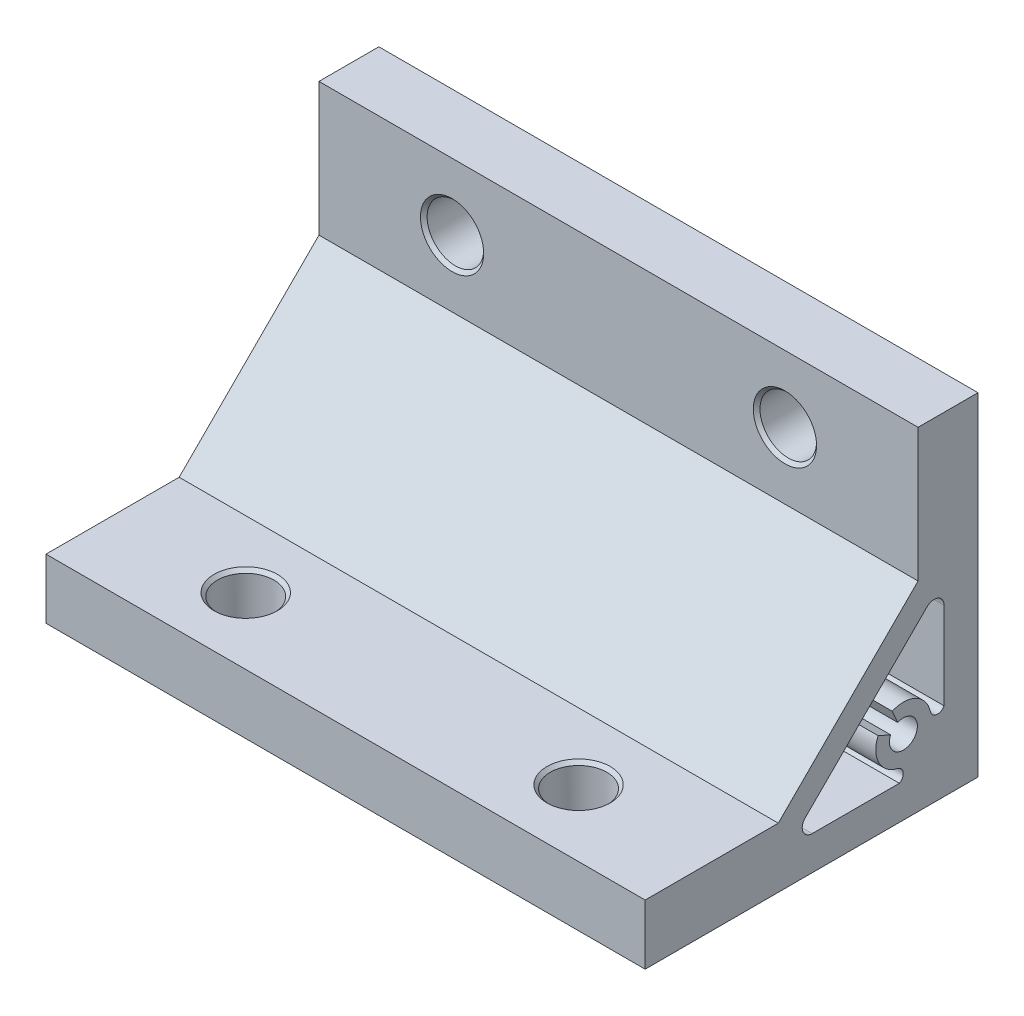
ISO-10303-21;
HEADER;
FILE_DESCRIPTION(('STEP AP214'),'2;1');
FILE_NAME('part.step','',(''),(''),'','','');
FILE_SCHEMA(('AUTOMOTIVE_DESIGN { 1 0 10303 214 1 1 1 1 }'));
ENDSEC;
DATA;
#1=APPLICATION_CONTEXT('core data for automotive mechanical design processes');
#2=APPLICATION_PROTOCOL_DEFINITION('international standard','automotive_design',2000,#1);
#3=PRODUCT_CONTEXT('',#1,'mechanical');
#4=PRODUCT('Part','Part','',(#3));
#5=PRODUCT_RELATED_PRODUCT_CATEGORY('part','',(#4));
#6=PRODUCT_DEFINITION_FORMATION('','',#4);
#7=PRODUCT_DEFINITION_CONTEXT('part definition',#1,'design');
#8=PRODUCT_DEFINITION('design','',#6,#7);
#9=PRODUCT_DEFINITION_SHAPE('','',#8);
#10=(LENGTH_UNIT() NAMED_UNIT(*) SI_UNIT(.MILLI.,.METRE.));
#11=(NAMED_UNIT(*) PLANE_ANGLE_UNIT() SI_UNIT($,.RADIAN.));
#12=(NAMED_UNIT(*) SI_UNIT($,.STERADIAN.) SOLID_ANGLE_UNIT());
#13=UNCERTAINTY_MEASURE_WITH_UNIT(LENGTH_MEASURE(1.E-05),#10,'distance_accuracy_value','');
#14=(GEOMETRIC_REPRESENTATION_CONTEXT(3) GLOBAL_UNCERTAINTY_ASSIGNED_CONTEXT((#13)) GLOBAL_UNIT_ASSIGNED_CONTEXT((#10,
#11,#12)) REPRESENTATION_CONTEXT('',''));
#15=CARTESIAN_POINT('',(0.,0.,0.));
#16=DIRECTION('',(0.,0.,1.));
#17=DIRECTION('',(1.,0.,0.));
#18=AXIS2_PLACEMENT_3D('',#15,#16,#17);
#19=CARTESIAN_POINT('',(25.,9.,25.));
#20=DIRECTION('',(0.,0.,-1.));
#21=DIRECTION('',(0.,1.,0.));
#22=AXIS2_PLACEMENT_3D('',#19,#20,#21);
#23=PLANE('',#22);
#24=DIRECTION('',(0.,-1.,0.));
#25=VECTOR('',#24,1.);
#26=CARTESIAN_POINT('',(-20.,50.,25.));
#27=LINE('',#26,#25);
#28=CARTESIAN_POINT('',(-20.,9.,25.));
#29=VERTEX_POINT('',#28);
#30=CARTESIAN_POINT('',(-20.,0.,25.));
#31=VERTEX_POINT('',#30);
#32=EDGE_CURVE('E39',#29,#31,#27,.T.);
#33=ORIENTED_EDGE('',*,*,#32,.T.);
#34=DIRECTION('',(-1.,0.,0.));
#35=VECTOR('',#34,1.);
#36=CARTESIAN_POINT('',(25.,0.,25.));
#37=LINE('',#36,#35);
#38=CARTESIAN_POINT('',(70.,0.,25.));
#39=VERTEX_POINT('',#38);
#40=EDGE_CURVE('E164',#39,#31,#37,.T.);
#41=ORIENTED_EDGE('',*,*,#40,.F.);
#42=DIRECTION('',(0.,1.,0.));
#43=VECTOR('',#42,1.);
#44=CARTESIAN_POINT('',(70.,50.,25.));
#45=LINE('',#44,#43);
#46=CARTESIAN_POINT('',(70.,9.,25.));
#47=VERTEX_POINT('',#46);
#48=EDGE_CURVE('E155',#39,#47,#45,.T.);
#49=ORIENTED_EDGE('',*,*,#48,.T.);
#50=DIRECTION('',(-1.,0.,0.));
#51=VECTOR('',#50,1.);
#52=CARTESIAN_POINT('',(25.,9.,25.));
#53=LINE('',#52,#51);
#54=EDGE_CURVE('E298',#47,#29,#53,.T.);
#55=ORIENTED_EDGE('',*,*,#54,.T.);
#56=EDGE_LOOP('',(#33,#41,#49,#55));
#57=FACE_BOUND('',#56,.T.);
#58=ADVANCED_FACE('F16',(#57),#23,.F.);
#59=CARTESIAN_POINT('',(25.,0.,25.));
#60=DIRECTION('',(0.,1.,0.));
#61=DIRECTION('',(0.,0.,1.));
#62=AXIS2_PLACEMENT_3D('',#59,#60,#61);
#63=PLANE('',#62);
#64=CARTESIAN_POINT('',(0.,0.,15.));
#65=DIRECTION('',(0.,1.,0.));
#66=DIRECTION('',(0.,0.,1.));
#67=AXIS2_PLACEMENT_3D('',#64,#65,#66);
#68=CIRCLE('',#67,4.74999999999999);
#69=CARTESIAN_POINT('',(0.,0.,19.75));
#70=VERTEX_POINT('',#69);
#71=EDGE_CURVE('E188',#70,#70,#68,.T.);
#72=ORIENTED_EDGE('',*,*,#71,.T.);
#73=EDGE_LOOP('',(#72));
#74=FACE_BOUND('',#73,.T.);
#75=CARTESIAN_POINT('',(50.,0.,15.));
#76=DIRECTION('',(0.,-1.,0.));
#77=DIRECTION('',(0.,0.,1.));
#78=AXIS2_PLACEMENT_3D('',#75,#76,#77);
#79=CIRCLE('',#78,4.74999999999999);
#80=CARTESIAN_POINT('',(50.,0.,19.75));
#81=VERTEX_POINT('',#80);
#82=EDGE_CURVE('E271',#81,#81,#79,.T.);
#83=ORIENTED_EDGE('',*,*,#82,.F.);
#84=EDGE_LOOP('',(#83));
#85=FACE_BOUND('',#84,.T.);
#86=DIRECTION('',(0.,0.,1.));
#87=VECTOR('',#86,1.);
#88=CARTESIAN_POINT('',(-20.,0.,-25.));
#89=LINE('',#88,#87);
#90=CARTESIAN_POINT('',(-20.,0.,-25.));
#91=VERTEX_POINT('',#90);
#92=EDGE_CURVE('E147',#91,#31,#89,.T.);
#93=ORIENTED_EDGE('',*,*,#92,.F.);
#94=DIRECTION('',(-1.,0.,0.));
#95=VECTOR('',#94,1.);
#96=CARTESIAN_POINT('',(25.,0.,-25.));
#97=LINE('',#96,#95);
#98=CARTESIAN_POINT('',(70.,0.,-25.));
#99=VERTEX_POINT('',#98);
#100=EDGE_CURVE('E162',#99,#91,#97,.T.);
#101=ORIENTED_EDGE('',*,*,#100,.F.);
#102=DIRECTION('',(0.,0.,1.));
#103=VECTOR('',#102,1.);
#104=CARTESIAN_POINT('',(70.,0.,-25.));
#105=LINE('',#104,#103);
#106=EDGE_CURVE('E165',#99,#39,#105,.T.);
#107=ORIENTED_EDGE('',*,*,#106,.T.);
#108=ORIENTED_EDGE('',*,*,#40,.T.);
#109=EDGE_LOOP('',(#93,#101,#107,#108));
#110=FACE_BOUND('',#109,.T.);
#111=ADVANCED_FACE('F160',(#74,#85,#110),#63,.F.);
#112=CARTESIAN_POINT('',(25.,0.,-25.));
#113=DIRECTION('',(0.,0.,1.));
#114=DIRECTION('',(0.,-1.,0.));
#115=AXIS2_PLACEMENT_3D('',#112,#113,#114);
#116=PLANE('',#115);
#117=CARTESIAN_POINT('',(0.,40.,-25.));
#118=DIRECTION('',(0.,0.,1.));
#119=DIRECTION('',(0.,-1.,0.));
#120=AXIS2_PLACEMENT_3D('',#117,#118,#119);
#121=CIRCLE('',#120,4.74999999999999);
#122=CARTESIAN_POINT('',(0.,35.25,-25.));
#123=VERTEX_POINT('',#122);
#124=EDGE_CURVE('E197',#123,#123,#121,.T.);
#125=ORIENTED_EDGE('',*,*,#124,.T.);
#126=EDGE_LOOP('',(#125));
#127=FACE_BOUND('',#126,.T.);
#128=CARTESIAN_POINT('',(50.,40.,-25.));
#129=DIRECTION('',(0.,0.,-1.));
#130=DIRECTION('',(0.,-1.,0.));
#131=AXIS2_PLACEMENT_3D('',#128,#129,#130);
#132=CIRCLE('',#131,4.74999999999999);
#133=CARTESIAN_POINT('',(50.,35.25,-25.));
#134=VERTEX_POINT('',#133);
#135=EDGE_CURVE('E280',#134,#134,#132,.T.);
#136=ORIENTED_EDGE('',*,*,#135,.F.);
#137=EDGE_LOOP('',(#136));
#138=FACE_BOUND('',#137,.T.);
#139=DIRECTION('',(0.,-1.,0.));
#140=VECTOR('',#139,1.);
#141=CARTESIAN_POINT('',(-20.,50.,-25.));
#142=LINE('',#141,#140);
#143=CARTESIAN_POINT('',(-20.,50.,-25.));
#144=VERTEX_POINT('',#143);
#145=EDGE_CURVE('E144',#144,#91,#142,.T.);
#146=ORIENTED_EDGE('',*,*,#145,.F.);
#147=DIRECTION('',(-1.,0.,0.));
#148=VECTOR('',#147,1.);
#149=CARTESIAN_POINT('',(25.,50.,-25.));
#150=LINE('',#149,#148);
#151=CARTESIAN_POINT('',(70.,50.,-25.));
#152=VERTEX_POINT('',#151);
#153=EDGE_CURVE('E169',#152,#144,#150,.T.);
#154=ORIENTED_EDGE('',*,*,#153,.F.);
#155=DIRECTION('',(0.,1.,0.));
#156=VECTOR('',#155,1.);
#157=CARTESIAN_POINT('',(70.,50.,-25.));
#158=LINE('',#157,#156);
#159=EDGE_CURVE('E154',#99,#152,#158,.T.);
#160=ORIENTED_EDGE('',*,*,#159,.F.);
#161=ORIENTED_EDGE('',*,*,#100,.T.);
#162=EDGE_LOOP('',(#146,#154,#160,#161));
#163=FACE_BOUND('',#162,.T.);
#164=ADVANCED_FACE('F168',(#127,#138,#163),#116,.F.);
#165=CARTESIAN_POINT('',(25.,50.,-25.));
#166=DIRECTION('',(0.,-1.,0.));
#167=DIRECTION('',(0.,0.,-1.));
#168=AXIS2_PLACEMENT_3D('',#165,#166,#167);
#169=PLANE('',#168);
#170=DIRECTION('',(0.,0.,1.));
#171=VECTOR('',#170,1.);
#172=CARTESIAN_POINT('',(-20.,50.,-25.));
#173=LINE('',#172,#171);
#174=CARTESIAN_POINT('',(-20.,50.,-16.));
#175=VERTEX_POINT('',#174);
#176=EDGE_CURVE('E149',#144,#175,#173,.T.);
#177=ORIENTED_EDGE('',*,*,#176,.T.);
#178=DIRECTION('',(-1.,0.,0.));
#179=VECTOR('',#178,1.);
#180=CARTESIAN_POINT('',(25.,50.,-16.));
#181=LINE('',#180,#179);
#182=CARTESIAN_POINT('',(70.,50.,-16.));
#183=VERTEX_POINT('',#182);
#184=EDGE_CURVE('E173',#183,#175,#181,.T.);
#185=ORIENTED_EDGE('',*,*,#184,.F.);
#186=DIRECTION('',(0.,0.,1.));
#187=VECTOR('',#186,1.);
#188=CARTESIAN_POINT('',(70.,50.,-25.));
#189=LINE('',#188,#187);
#190=EDGE_CURVE('E335',#152,#183,#189,.T.);
#191=ORIENTED_EDGE('',*,*,#190,.F.);
#192=ORIENTED_EDGE('',*,*,#153,.T.);
#193=EDGE_LOOP('',(#177,#185,#191,#192));
#194=FACE_BOUND('',#193,.T.);
#195=ADVANCED_FACE('F334',(#194),#169,.F.);
#196=CARTESIAN_POINT('',(25.,50.,-16.));
#197=DIRECTION('',(0.,0.,-1.));
#198=DIRECTION('',(0.,1.,0.));
#199=AXIS2_PLACEMENT_3D('',#196,#197,#198);
#200=PLANE('',#199);
#201=CARTESIAN_POINT('',(0.,40.,-16.));
#202=DIRECTION('',(0.,0.,-1.));
#203=DIRECTION('',(0.,1.,0.));
#204=AXIS2_PLACEMENT_3D('',#201,#202,#203);
#205=CIRCLE('',#204,4.75000000000002);
#206=CARTESIAN_POINT('',(0.,44.75,-16.));
#207=VERTEX_POINT('',#206);
#208=EDGE_CURVE('E209',#207,#207,#205,.T.);
#209=ORIENTED_EDGE('',*,*,#208,.T.);
#210=EDGE_LOOP('',(#209));
#211=FACE_BOUND('',#210,.T.);
#212=CARTESIAN_POINT('',(50.,40.,-16.));
#213=DIRECTION('',(0.,0.,1.));
#214=DIRECTION('',(0.,1.,0.));
#215=AXIS2_PLACEMENT_3D('',#212,#213,#214);
#216=CIRCLE('',#215,4.75000000000002);
#217=CARTESIAN_POINT('',(50.,44.75,-16.));
#218=VERTEX_POINT('',#217);
#219=EDGE_CURVE('E292',#218,#218,#216,.T.);
#220=ORIENTED_EDGE('',*,*,#219,.F.);
#221=EDGE_LOOP('',(#220));
#222=FACE_BOUND('',#221,.T.);
#223=DIRECTION('',(0.,1.,0.));
#224=VECTOR('',#223,1.);
#225=CARTESIAN_POINT('',(-20.,50.,-16.));
#226=LINE('',#225,#224);
#227=CARTESIAN_POINT('',(-20.,30.,-16.));
#228=VERTEX_POINT('',#227);
#229=EDGE_CURVE('E269',#228,#175,#226,.T.);
#230=ORIENTED_EDGE('',*,*,#229,.F.);
#231=DIRECTION('',(-1.,0.,0.));
#232=VECTOR('',#231,1.);
#233=CARTESIAN_POINT('',(25.,30.,-16.));
#234=LINE('',#233,#232);
#235=CARTESIAN_POINT('',(70.,30.,-16.));
#236=VERTEX_POINT('',#235);
#237=EDGE_CURVE('E323',#236,#228,#234,.T.);
#238=ORIENTED_EDGE('',*,*,#237,.F.);
#239=DIRECTION('',(0.,-1.,0.));
#240=VECTOR('',#239,1.);
#241=CARTESIAN_POINT('',(70.,50.,-16.));
#242=LINE('',#241,#240);
#243=EDGE_CURVE('E242',#183,#236,#242,.T.);
#244=ORIENTED_EDGE('',*,*,#243,.F.);
#245=ORIENTED_EDGE('',*,*,#184,.T.);
#246=EDGE_LOOP('',(#230,#238,#244,#245));
#247=FACE_BOUND('',#246,.T.);
#248=ADVANCED_FACE('F330',(#211,#222,#247),#200,.F.);
#249=CARTESIAN_POINT('',(25.,30.,-16.));
#250=DIRECTION('',(0.,-0.707106781186547,-0.707106781186548));
#251=DIRECTION('',(0.,0.707106781186548,-0.707106781186547));
#252=AXIS2_PLACEMENT_3D('',#249,#250,#251);
#253=PLANE('',#252);
#254=DIRECTION('',(0.,0.707106781186548,-0.707106781186547));
#255=VECTOR('',#254,1.);
#256=CARTESIAN_POINT('',(-20.,30.,-16.));
#257=LINE('',#256,#255);
#258=CARTESIAN_POINT('',(-20.,9.,5.));
#259=VERTEX_POINT('',#258);
#260=EDGE_CURVE('E267',#259,#228,#257,.T.);
#261=ORIENTED_EDGE('',*,*,#260,.F.);
#262=DIRECTION('',(-1.,0.,0.));
#263=VECTOR('',#262,1.);
#264=CARTESIAN_POINT('',(25.,9.,5.));
#265=LINE('',#264,#263);
#266=CARTESIAN_POINT('',(70.,9.,5.));
#267=VERTEX_POINT('',#266);
#268=EDGE_CURVE('E320',#267,#259,#265,.T.);
#269=ORIENTED_EDGE('',*,*,#268,.F.);
#270=DIRECTION('',(0.,-0.707106781186548,0.707106781186547));
#271=VECTOR('',#270,1.);
#272=CARTESIAN_POINT('',(70.,30.,-16.));
#273=LINE('',#272,#271);
#274=EDGE_CURVE('E31',#236,#267,#273,.T.);
#275=ORIENTED_EDGE('',*,*,#274,.F.);
#276=ORIENTED_EDGE('',*,*,#237,.T.);
#277=EDGE_LOOP('',(#261,#269,#275,#276));
#278=FACE_BOUND('',#277,.T.);
#279=ADVANCED_FACE('F368',(#278),#253,.F.);
#280=CARTESIAN_POINT('',(25.,9.,5.));
#281=DIRECTION('',(0.,-1.,0.));
#282=DIRECTION('',(0.,0.,-1.));
#283=AXIS2_PLACEMENT_3D('',#280,#281,#282);
#284=PLANE('',#283);
#285=CARTESIAN_POINT('',(0.,9.,15.));
#286=DIRECTION('',(0.,-1.,0.));
#287=DIRECTION('',(0.,0.,-1.));
#288=AXIS2_PLACEMENT_3D('',#285,#286,#287);
#289=CIRCLE('',#288,4.75000000000002);
#290=CARTESIAN_POINT('',(0.,9.,10.25));
#291=VERTEX_POINT('',#290);
#292=EDGE_CURVE('E206',#291,#291,#289,.T.);
#293=ORIENTED_EDGE('',*,*,#292,.T.);
#294=EDGE_LOOP('',(#293));
#295=FACE_BOUND('',#294,.T.);
#296=CARTESIAN_POINT('',(50.,9.,15.));
#297=DIRECTION('',(0.,1.,0.));
#298=DIRECTION('',(0.,0.,-1.));
#299=AXIS2_PLACEMENT_3D('',#296,#297,#298);
#300=CIRCLE('',#299,4.75000000000002);
#301=CARTESIAN_POINT('',(50.,9.,10.25));
#302=VERTEX_POINT('',#301);
#303=EDGE_CURVE('E289',#302,#302,#300,.T.);
#304=ORIENTED_EDGE('',*,*,#303,.F.);
#305=EDGE_LOOP('',(#304));
#306=FACE_BOUND('',#305,.T.);
#307=DIRECTION('',(0.,0.,-1.));
#308=VECTOR('',#307,1.);
#309=CARTESIAN_POINT('',(-20.,9.,5.));
#310=LINE('',#309,#308);
#311=EDGE_CURVE('E265',#29,#259,#310,.T.);
#312=ORIENTED_EDGE('',*,*,#311,.F.);
#313=ORIENTED_EDGE('',*,*,#54,.F.);
#314=DIRECTION('',(0.,0.,1.));
#315=VECTOR('',#314,1.);
#316=CARTESIAN_POINT('',(70.,9.,5.));
#317=LINE('',#316,#315);
#318=EDGE_CURVE('E359',#267,#47,#317,.T.);
#319=ORIENTED_EDGE('',*,*,#318,.F.);
#320=ORIENTED_EDGE('',*,*,#268,.T.);
#321=EDGE_LOOP('',(#312,#313,#319,#320));
#322=FACE_BOUND('',#321,.T.);
#323=ADVANCED_FACE('F365',(#295,#306,#322),#284,.F.);
#324=CARTESIAN_POINT('',(0.,40.,-25.));
#325=DIRECTION('',(0.,0.,1.));
#326=DIRECTION('',(1.,0.,0.));
#327=AXIS2_PLACEMENT_3D('',#324,#325,#326);
#328=CYLINDRICAL_SURFACE('',#327,4.25);
#329=CARTESIAN_POINT('',(0.,40.,-24.5));
#330=DIRECTION('',(0.,0.,1.));
#331=DIRECTION('',(1.,0.,0.));
#332=AXIS2_PLACEMENT_3D('',#329,#330,#331);
#333=CIRCLE('',#332,4.25);
#334=CARTESIAN_POINT('',(4.25000000000001,40.,-24.5));
#335=VERTEX_POINT('',#334);
#336=EDGE_CURVE('E203',#335,#335,#333,.F.);
#337=ORIENTED_EDGE('',*,*,#336,.T.);
#338=EDGE_LOOP('',(#337));
#339=FACE_BOUND('',#338,.T.);
#340=CARTESIAN_POINT('',(0.,40.,-16.5));
#341=DIRECTION('',(0.,0.,-1.));
#342=DIRECTION('',(-1.,0.,0.));
#343=AXIS2_PLACEMENT_3D('',#340,#341,#342);
#344=CIRCLE('',#343,4.25);
#345=CARTESIAN_POINT('',(-4.25,40.,-16.5));
#346=VERTEX_POINT('',#345);
#347=EDGE_CURVE('E200',#346,#346,#344,.F.);
#348=ORIENTED_EDGE('',*,*,#347,.T.);
#349=EDGE_LOOP('',(#348));
#350=FACE_BOUND('',#349,.T.);
#351=ADVANCED_FACE('F376',(#339,#350),#328,.F.);
#352=CARTESIAN_POINT('',(0.,0.,15.));
#353=DIRECTION('',(0.,1.,0.));
#354=DIRECTION('',(0.,0.,1.));
#355=AXIS2_PLACEMENT_3D('',#352,#353,#354);
#356=CYLINDRICAL_SURFACE('',#355,4.25);
#357=CARTESIAN_POINT('',(0.,0.499999999999995,15.));
#358=DIRECTION('',(0.,1.,0.));
#359=DIRECTION('',(0.,0.,1.));
#360=AXIS2_PLACEMENT_3D('',#357,#358,#359);
#361=CIRCLE('',#360,4.25);
#362=CARTESIAN_POINT('',(0.,0.499999999999995,19.25));
#363=VERTEX_POINT('',#362);
#364=EDGE_CURVE('E194',#363,#363,#361,.F.);
#365=ORIENTED_EDGE('',*,*,#364,.T.);
#366=EDGE_LOOP('',(#365));
#367=FACE_BOUND('',#366,.T.);
#368=CARTESIAN_POINT('',(0.,8.49999999999998,15.));
#369=DIRECTION('',(0.,-1.,0.));
#370=DIRECTION('',(0.,0.,-1.));
#371=AXIS2_PLACEMENT_3D('',#368,#369,#370);
#372=CIRCLE('',#371,4.25);
#373=CARTESIAN_POINT('',(0.,8.49999999999998,10.75));
#374=VERTEX_POINT('',#373);
#375=EDGE_CURVE('E191',#374,#374,#372,.F.);
#376=ORIENTED_EDGE('',*,*,#375,.T.);
#377=EDGE_LOOP('',(#376));
#378=FACE_BOUND('',#377,.T.);
#379=ADVANCED_FACE('F400',(#367,#378),#356,.F.);
#380=CARTESIAN_POINT('',(0.,0.,15.));
#381=DIRECTION('',(0.,-1.,0.));
#382=DIRECTION('',(0.,0.,-1.));
#383=AXIS2_PLACEMENT_3D('',#380,#381,#382);
#384=CONICAL_SURFACE('',#383,4.74999999999999,0.785398163397443);
#385=ORIENTED_EDGE('',*,*,#364,.F.);
#386=EDGE_LOOP('',(#385));
#387=FACE_BOUND('',#386,.T.);
#388=ORIENTED_EDGE('',*,*,#71,.F.);
#389=EDGE_LOOP('',(#388));
#390=FACE_BOUND('',#389,.T.);
#391=ADVANCED_FACE('F396',(#387,#390),#384,.F.);
#392=CARTESIAN_POINT('',(0.,40.,-25.));
#393=DIRECTION('',(0.,0.,-1.));
#394=DIRECTION('',(-1.,0.,0.));
#395=AXIS2_PLACEMENT_3D('',#392,#393,#394);
#396=CONICAL_SURFACE('',#395,4.74999999999999,0.785398163397452);
#397=ORIENTED_EDGE('',*,*,#336,.F.);
#398=EDGE_LOOP('',(#397));
#399=FACE_BOUND('',#398,.T.);
#400=ORIENTED_EDGE('',*,*,#124,.F.);
#401=EDGE_LOOP('',(#400));
#402=FACE_BOUND('',#401,.T.);
#403=ADVANCED_FACE('F399',(#399,#402),#396,.F.);
#404=CARTESIAN_POINT('',(0.,8.49999999999998,15.));
#405=DIRECTION('',(0.,1.,0.));
#406=DIRECTION('',(0.,0.,1.));
#407=AXIS2_PLACEMENT_3D('',#404,#405,#406);
#408=CONICAL_SURFACE('',#407,4.25,0.785398163397442);
#409=ORIENTED_EDGE('',*,*,#292,.F.);
#410=EDGE_LOOP('',(#409));
#411=FACE_BOUND('',#410,.T.);
#412=ORIENTED_EDGE('',*,*,#375,.F.);
#413=EDGE_LOOP('',(#412));
#414=FACE_BOUND('',#413,.T.);
#415=ADVANCED_FACE('F403',(#411,#414),#408,.F.);
#416=CARTESIAN_POINT('',(0.,40.,-16.5));
#417=DIRECTION('',(0.,0.,1.));
#418=DIRECTION('',(1.,0.,0.));
#419=AXIS2_PLACEMENT_3D('',#416,#417,#418);
#420=CONICAL_SURFACE('',#419,4.25,0.785398163397441);
#421=ORIENTED_EDGE('',*,*,#208,.F.);
#422=EDGE_LOOP('',(#421));
#423=FACE_BOUND('',#422,.T.);
#424=ORIENTED_EDGE('',*,*,#347,.F.);
#425=EDGE_LOOP('',(#424));
#426=FACE_BOUND('',#425,.T.);
#427=ADVANCED_FACE('F18',(#423,#426),#420,.F.);
#428=CARTESIAN_POINT('',(50.,40.,-25.));
#429=DIRECTION('',(0.,0.,1.));
#430=DIRECTION('',(-1.,0.,0.));
#431=AXIS2_PLACEMENT_3D('',#428,#429,#430);
#432=CYLINDRICAL_SURFACE('',#431,4.25);
#433=CARTESIAN_POINT('',(50.,40.,-24.5));
#434=DIRECTION('',(0.,0.,-1.));
#435=DIRECTION('',(-1.,0.,0.));
#436=AXIS2_PLACEMENT_3D('',#433,#434,#435);
#437=CIRCLE('',#436,4.25);
#438=CARTESIAN_POINT('',(45.75,40.,-24.5));
#439=VERTEX_POINT('',#438);
#440=EDGE_CURVE('E286',#439,#439,#437,.F.);
#441=ORIENTED_EDGE('',*,*,#440,.F.);
#442=EDGE_LOOP('',(#441));
#443=FACE_BOUND('',#442,.T.);
#444=CARTESIAN_POINT('',(50.,40.,-16.5));
#445=DIRECTION('',(0.,0.,1.));
#446=DIRECTION('',(1.,0.,0.));
#447=AXIS2_PLACEMENT_3D('',#444,#445,#446);
#448=CIRCLE('',#447,4.25);
#449=CARTESIAN_POINT('',(54.25,40.,-16.5));
#450=VERTEX_POINT('',#449);
#451=EDGE_CURVE('E283',#450,#450,#448,.F.);
#452=ORIENTED_EDGE('',*,*,#451,.F.);
#453=EDGE_LOOP('',(#452));
#454=FACE_BOUND('',#453,.T.);
#455=ADVANCED_FACE('F410',(#443,#454),#432,.F.);
#456=CARTESIAN_POINT('',(50.,0.,15.));
#457=DIRECTION('',(0.,1.,0.));
#458=DIRECTION('',(0.,0.,1.));
#459=AXIS2_PLACEMENT_3D('',#456,#457,#458);
#460=CYLINDRICAL_SURFACE('',#459,4.25);
#461=CARTESIAN_POINT('',(50.,0.499999999999995,15.));
#462=DIRECTION('',(0.,-1.,0.));
#463=DIRECTION('',(0.,0.,1.));
#464=AXIS2_PLACEMENT_3D('',#461,#462,#463);
#465=CIRCLE('',#464,4.25);
#466=CARTESIAN_POINT('',(50.,0.499999999999995,19.25));
#467=VERTEX_POINT('',#466);
#468=EDGE_CURVE('E277',#467,#467,#465,.F.);
#469=ORIENTED_EDGE('',*,*,#468,.F.);
#470=EDGE_LOOP('',(#469));
#471=FACE_BOUND('',#470,.T.);
#472=CARTESIAN_POINT('',(50.,8.49999999999998,15.));
#473=DIRECTION('',(0.,1.,0.));
#474=DIRECTION('',(0.,0.,-1.));
#475=AXIS2_PLACEMENT_3D('',#472,#473,#474);
#476=CIRCLE('',#475,4.25);
#477=CARTESIAN_POINT('',(50.,8.49999999999998,10.75));
#478=VERTEX_POINT('',#477);
#479=EDGE_CURVE('E274',#478,#478,#476,.F.);
#480=ORIENTED_EDGE('',*,*,#479,.F.);
#481=EDGE_LOOP('',(#480));
#482=FACE_BOUND('',#481,.T.);
#483=ADVANCED_FACE('F568',(#471,#482),#460,.F.);
#484=CARTESIAN_POINT('',(50.,0.,15.));
#485=DIRECTION('',(0.,-1.,0.));
#486=DIRECTION('',(0.,0.,-1.));
#487=AXIS2_PLACEMENT_3D('',#484,#485,#486);
#488=CONICAL_SURFACE('',#487,4.74999999999999,0.785398163397443);
#489=ORIENTED_EDGE('',*,*,#468,.T.);
#490=EDGE_LOOP('',(#489));
#491=FACE_BOUND('',#490,.T.);
#492=ORIENTED_EDGE('',*,*,#82,.T.);
#493=EDGE_LOOP('',(#492));
#494=FACE_BOUND('',#493,.T.);
#495=ADVANCED_FACE('F559',(#491,#494),#488,.F.);
#496=CARTESIAN_POINT('',(50.,40.,-25.));
#497=DIRECTION('',(0.,0.,-1.));
#498=DIRECTION('',(1.,0.,0.));
#499=AXIS2_PLACEMENT_3D('',#496,#497,#498);
#500=CONICAL_SURFACE('',#499,4.74999999999999,0.785398163397452);
#501=ORIENTED_EDGE('',*,*,#440,.T.);
#502=EDGE_LOOP('',(#501));
#503=FACE_BOUND('',#502,.T.);
#504=ORIENTED_EDGE('',*,*,#135,.T.);
#505=EDGE_LOOP('',(#504));
#506=FACE_BOUND('',#505,.T.);
#507=ADVANCED_FACE('F551',(#503,#506),#500,.F.);
#508=CARTESIAN_POINT('',(50.,8.49999999999998,15.));
#509=DIRECTION('',(0.,1.,0.));
#510=DIRECTION('',(0.,0.,1.));
#511=AXIS2_PLACEMENT_3D('',#508,#509,#510);
#512=CONICAL_SURFACE('',#511,4.25,0.785398163397442);
#513=ORIENTED_EDGE('',*,*,#303,.T.);
#514=EDGE_LOOP('',(#513));
#515=FACE_BOUND('',#514,.T.);
#516=ORIENTED_EDGE('',*,*,#479,.T.);
#517=EDGE_LOOP('',(#516));
#518=FACE_BOUND('',#517,.T.);
#519=ADVANCED_FACE('F543',(#515,#518),#512,.F.);
#520=CARTESIAN_POINT('',(50.,40.,-16.5));
#521=DIRECTION('',(0.,0.,1.));
#522=DIRECTION('',(-1.,0.,0.));
#523=AXIS2_PLACEMENT_3D('',#520,#521,#522);
#524=CONICAL_SURFACE('',#523,4.25,0.785398163397441);
#525=ORIENTED_EDGE('',*,*,#219,.T.);
#526=EDGE_LOOP('',(#525));
#527=FACE_BOUND('',#526,.T.);
#528=ORIENTED_EDGE('',*,*,#451,.T.);
#529=EDGE_LOOP('',(#528));
#530=FACE_BOUND('',#529,.T.);
#531=ADVANCED_FACE('F425',(#527,#530),#524,.F.);
#532=CARTESIAN_POINT('',(70.,50.,-25.));
#533=DIRECTION('',(1.,0.,0.));
#534=DIRECTION('',(0.,0.,-1.));
#535=AXIS2_PLACEMENT_3D('',#532,#533,#534);
#536=PLANE('',#535);
#537=CARTESIAN_POINT('',(70.,24.9046681194226,-18.4));
#538=DIRECTION('',(1.,0.,0.));
#539=DIRECTION('',(0.,0.,-1.));
#540=AXIS2_PLACEMENT_3D('',#537,#538,#539);
#541=CIRCLE('',#540,1.5);
#542=CARTESIAN_POINT('',(70.,25.9653282912024,-17.3393398282202));
#543=VERTEX_POINT('',#542);
#544=CARTESIAN_POINT('',(70.,24.9046681194226,-19.9));
#545=VERTEX_POINT('',#544);
#546=EDGE_CURVE('E226',#543,#545,#541,.F.);
#547=ORIENTED_EDGE('',*,*,#546,.T.);
#548=DIRECTION('',(0.,-1.,0.));
#549=VECTOR('',#548,1.);
#550=CARTESIAN_POINT('',(70.,11.8175144212722,-19.9));
#551=LINE('',#550,#549);
#552=CARTESIAN_POINT('',(70.,11.8175144212722,-19.9));
#553=VERTEX_POINT('',#552);
#554=EDGE_CURVE('E227',#545,#553,#551,.T.);
#555=ORIENTED_EDGE('',*,*,#554,.T.);
#556=CARTESIAN_POINT('',(70.,12.3315574267284,-18.9238670543259));
#557=DIRECTION('',(1.,0.,0.));
#558=DIRECTION('',(0.,0.,-1.));
#559=AXIS2_PLACEMENT_3D('',#556,#557,#558);
#560=CIRCLE('',#559,1.10321155681434);
#561=CARTESIAN_POINT('',(70.,12.1057315128375,-17.8440159554683));
#562=VERTEX_POINT('',#561);
#563=EDGE_CURVE('E355',#553,#562,#560,.F.);
#564=ORIENTED_EDGE('',*,*,#563,.T.);
#565=CARTESIAN_POINT('',(70.,11.2076424818068,-13.7923575181932));
#566=DIRECTION('',(1.,0.,0.));
#567=DIRECTION('',(0.,0.,-1.));
#568=AXIS2_PLACEMENT_3D('',#565,#566,#567);
#569=CIRCLE('',#568,4.15);
#570=CARTESIAN_POINT('',(70.,15.0044038944035,-12.1169164491561));
#571=VERTEX_POINT('',#570);
#572=EDGE_CURVE('E353',#562,#571,#569,.T.);
#573=ORIENTED_EDGE('',*,*,#572,.T.);
#574=DIRECTION('',(0.,-0.914882268095605,-0.403720739527017));
#575=VECTOR('',#574,1.);
#576=CARTESIAN_POINT('',(70.,15.0044038944035,-12.1169164491561));
#577=LINE('',#576,#575);
#578=CARTESIAN_POINT('',(70.,13.1288952448075,-12.9445439651865));
#579=VERTEX_POINT('',#578);
#580=EDGE_CURVE('E351',#571,#579,#577,.T.);
#581=ORIENTED_EDGE('',*,*,#580,.T.);
#582=CARTESIAN_POINT('',(70.,11.2076424818068,-13.7923575181932));
#583=DIRECTION('',(1.,0.,0.));
#584=DIRECTION('',(0.,0.,-1.));
#585=AXIS2_PLACEMENT_3D('',#582,#583,#584);
#586=CIRCLE('',#585,2.1);
#587=CARTESIAN_POINT('',(70.,12.0554560348135,-11.8711047551925));
#588=VERTEX_POINT('',#587);
#589=EDGE_CURVE('E349',#579,#588,#586,.F.);
#590=ORIENTED_EDGE('',*,*,#589,.T.);
#591=DIRECTION('',(0.,0.403720739527013,0.914882268095607));
#592=VECTOR('',#591,1.);
#593=CARTESIAN_POINT('',(70.,12.8830835508439,-9.99559610559646));
#594=LINE('',#593,#592);
#595=CARTESIAN_POINT('',(70.,12.8830835508439,-9.99559610559646));
#596=VERTEX_POINT('',#595);
#597=EDGE_CURVE('E347',#588,#596,#594,.T.);
#598=ORIENTED_EDGE('',*,*,#597,.T.);
#599=CARTESIAN_POINT('',(70.,11.2076424818068,-13.7923575181932));
#600=DIRECTION('',(1.,0.,0.));
#601=DIRECTION('',(0.,0.,-1.));
#602=AXIS2_PLACEMENT_3D('',#599,#600,#601);
#603=CIRCLE('',#602,4.15);
#604=CARTESIAN_POINT('',(70.,7.15598404453171,-12.8942684871625));
#605=VERTEX_POINT('',#604);
#606=EDGE_CURVE('E345',#596,#605,#603,.T.);
#607=ORIENTED_EDGE('',*,*,#606,.T.);
#608=CARTESIAN_POINT('',(70.,6.07613294567405,-12.6684425732716));
#609=DIRECTION('',(1.,0.,0.));
#610=DIRECTION('',(0.,0.,-1.));
#611=AXIS2_PLACEMENT_3D('',#608,#609,#610);
#612=CIRCLE('',#611,1.10321155681434);
#613=CARTESIAN_POINT('',(70.,5.1,-13.1824855787278));
#614=VERTEX_POINT('',#613);
#615=EDGE_CURVE('E337',#605,#614,#612,.F.);
#616=ORIENTED_EDGE('',*,*,#615,.T.);
#617=DIRECTION('',(0.,0.,1.));
#618=VECTOR('',#617,1.);
#619=CARTESIAN_POINT('',(70.,5.1,3.52598846298224));
#620=LINE('',#619,#618);
#621=CARTESIAN_POINT('',(70.,5.1,-0.0953318805774003));
#622=VERTEX_POINT('',#621);
#623=EDGE_CURVE('E218',#614,#622,#620,.T.);
#624=ORIENTED_EDGE('',*,*,#623,.T.);
#625=CARTESIAN_POINT('',(70.,6.6,-0.0953318805774006));
#626=DIRECTION('',(1.,0.,0.));
#627=DIRECTION('',(0.,0.,-1.));
#628=AXIS2_PLACEMENT_3D('',#625,#626,#627);
#629=CIRCLE('',#628,1.5);
#630=CARTESIAN_POINT('',(70.,7.66066017177983,0.965328291202417));
#631=VERTEX_POINT('',#630);
#632=EDGE_CURVE('E24',#622,#631,#629,.F.);
#633=ORIENTED_EDGE('',*,*,#632,.T.);
#634=DIRECTION('',(0.,0.707106781186548,-0.707106781186548));
#635=VECTOR('',#634,1.);
#636=CARTESIAN_POINT('',(70.,28.5259884629822,-19.9));
#637=LINE('',#636,#635);
#638=EDGE_CURVE('E215',#631,#543,#637,.T.);
#639=ORIENTED_EDGE('',*,*,#638,.T.);
#640=EDGE_LOOP('',(#547,#555,#564,#573,#581,#590,#598,#607,#616,#624,#633,#639));
#641=FACE_BOUND('',#640,.T.);
#642=ORIENTED_EDGE('',*,*,#243,.T.);
#643=ORIENTED_EDGE('',*,*,#274,.T.);
#644=ORIENTED_EDGE('',*,*,#318,.T.);
#645=ORIENTED_EDGE('',*,*,#48,.F.);
#646=ORIENTED_EDGE('',*,*,#106,.F.);
#647=ORIENTED_EDGE('',*,*,#159,.T.);
#648=ORIENTED_EDGE('',*,*,#190,.T.);
#649=EDGE_LOOP('',(#642,#643,#644,#645,#646,#647,#648));
#650=FACE_BOUND('',#649,.T.);
#651=ADVANCED_FACE('F214',(#641,#650),#536,.T.);
#652=CARTESIAN_POINT('',(-20.,50.,-25.));
#653=DIRECTION('',(-1.,0.,0.));
#654=DIRECTION('',(0.,-1.,0.));
#655=AXIS2_PLACEMENT_3D('',#652,#653,#654);
#656=PLANE('',#655);
#657=CARTESIAN_POINT('',(-20.,24.9046681194226,-18.4));
#658=DIRECTION('',(-1.,0.,0.));
#659=DIRECTION('',(0.,-1.,0.));
#660=AXIS2_PLACEMENT_3D('',#657,#658,#659);
#661=CIRCLE('',#660,1.5);
#662=CARTESIAN_POINT('',(-20.,24.9046681194226,-19.9));
#663=VERTEX_POINT('',#662);
#664=CARTESIAN_POINT('',(-20.,25.9653282912024,-17.3393398282202));
#665=VERTEX_POINT('',#664);
#666=EDGE_CURVE('E263',#663,#665,#661,.F.);
#667=ORIENTED_EDGE('',*,*,#666,.T.);
#668=DIRECTION('',(0.,-0.707106781186548,0.707106781186548));
#669=VECTOR('',#668,1.);
#670=CARTESIAN_POINT('',(-20.,28.5259884629822,-19.9));
#671=LINE('',#670,#669);
#672=CARTESIAN_POINT('',(-20.,7.66066017177982,0.96532829120242));
#673=VERTEX_POINT('',#672);
#674=EDGE_CURVE('E235',#665,#673,#671,.T.);
#675=ORIENTED_EDGE('',*,*,#674,.T.);
#676=CARTESIAN_POINT('',(-20.,6.6,-0.0953318805774006));
#677=DIRECTION('',(-1.,0.,0.));
#678=DIRECTION('',(0.,-1.,0.));
#679=AXIS2_PLACEMENT_3D('',#676,#677,#678);
#680=CIRCLE('',#679,1.5);
#681=CARTESIAN_POINT('',(-20.,5.1,-0.0953318805774006));
#682=VERTEX_POINT('',#681);
#683=EDGE_CURVE('E10',#673,#682,#680,.F.);
#684=ORIENTED_EDGE('',*,*,#683,.T.);
#685=DIRECTION('',(0.,0.,-1.));
#686=VECTOR('',#685,1.);
#687=CARTESIAN_POINT('',(-20.,5.1,3.52598846298224));
#688=LINE('',#687,#686);
#689=CARTESIAN_POINT('',(-20.,5.1,-13.1824855787278));
#690=VERTEX_POINT('',#689);
#691=EDGE_CURVE('E233',#682,#690,#688,.T.);
#692=ORIENTED_EDGE('',*,*,#691,.T.);
#693=CARTESIAN_POINT('',(-20.,6.07613294567405,-12.6684425732716));
#694=DIRECTION('',(-1.,0.,0.));
#695=DIRECTION('',(0.,-1.,0.));
#696=AXIS2_PLACEMENT_3D('',#693,#694,#695);
#697=CIRCLE('',#696,1.10321155681434);
#698=CARTESIAN_POINT('',(-20.,7.15598404453171,-12.8942684871625));
#699=VERTEX_POINT('',#698);
#700=EDGE_CURVE('E241',#690,#699,#697,.F.);
#701=ORIENTED_EDGE('',*,*,#700,.T.);
#702=CARTESIAN_POINT('',(-20.,11.2076424818068,-13.7923575181932));
#703=DIRECTION('',(-1.,0.,0.));
#704=DIRECTION('',(0.,-1.,0.));
#705=AXIS2_PLACEMENT_3D('',#702,#703,#704);
#706=CIRCLE('',#705,4.15);
#707=CARTESIAN_POINT('',(-20.,12.8830835508439,-9.99559610559646));
#708=VERTEX_POINT('',#707);
#709=EDGE_CURVE('E244',#699,#708,#706,.T.);
#710=ORIENTED_EDGE('',*,*,#709,.T.);
#711=DIRECTION('',(0.,-0.403720739527013,-0.914882268095607));
#712=VECTOR('',#711,1.);
#713=CARTESIAN_POINT('',(-20.,12.8830835508439,-9.99559610559646));
#714=LINE('',#713,#712);
#715=CARTESIAN_POINT('',(-20.,12.0554560348135,-11.8711047551925));
#716=VERTEX_POINT('',#715);
#717=EDGE_CURVE('E250',#708,#716,#714,.T.);
#718=ORIENTED_EDGE('',*,*,#717,.T.);
#719=CARTESIAN_POINT('',(-20.,11.2076424818068,-13.7923575181932));
#720=DIRECTION('',(-1.,0.,0.));
#721=DIRECTION('',(0.,-1.,0.));
#722=AXIS2_PLACEMENT_3D('',#719,#720,#721);
#723=CIRCLE('',#722,2.1);
#724=CARTESIAN_POINT('',(-20.,13.1288952448075,-12.9445439651865));
#725=VERTEX_POINT('',#724);
#726=EDGE_CURVE('E252',#716,#725,#723,.F.);
#727=ORIENTED_EDGE('',*,*,#726,.T.);
#728=DIRECTION('',(0.,0.914882268095605,0.403720739527017));
#729=VECTOR('',#728,1.);
#730=CARTESIAN_POINT('',(-20.,15.0044038944035,-12.1169164491561));
#731=LINE('',#730,#729);
#732=CARTESIAN_POINT('',(-20.,15.0044038944035,-12.1169164491561));
#733=VERTEX_POINT('',#732);
#734=EDGE_CURVE('E254',#725,#733,#731,.T.);
#735=ORIENTED_EDGE('',*,*,#734,.T.);
#736=CARTESIAN_POINT('',(-20.,11.2076424818068,-13.7923575181932));
#737=DIRECTION('',(-1.,0.,0.));
#738=DIRECTION('',(0.,-1.,0.));
#739=AXIS2_PLACEMENT_3D('',#736,#737,#738);
#740=CIRCLE('',#739,4.15);
#741=CARTESIAN_POINT('',(-20.,12.1057315128375,-17.8440159554683));
#742=VERTEX_POINT('',#741);
#743=EDGE_CURVE('E256',#733,#742,#740,.T.);
#744=ORIENTED_EDGE('',*,*,#743,.T.);
#745=CARTESIAN_POINT('',(-20.,12.3315574267284,-18.9238670543259));
#746=DIRECTION('',(-1.,0.,0.));
#747=DIRECTION('',(0.,-1.,0.));
#748=AXIS2_PLACEMENT_3D('',#745,#746,#747);
#749=CIRCLE('',#748,1.10321155681434);
#750=CARTESIAN_POINT('',(-20.,11.8175144212722,-19.9));
#751=VERTEX_POINT('',#750);
#752=EDGE_CURVE('E258',#742,#751,#749,.F.);
#753=ORIENTED_EDGE('',*,*,#752,.T.);
#754=DIRECTION('',(0.,1.,0.));
#755=VECTOR('',#754,1.);
#756=CARTESIAN_POINT('',(-20.,11.8175144212722,-19.9));
#757=LINE('',#756,#755);
#758=EDGE_CURVE('E260',#751,#663,#757,.T.);
#759=ORIENTED_EDGE('',*,*,#758,.T.);
#760=EDGE_LOOP('',(#667,#675,#684,#692,#701,#710,#718,#727,#735,#744,#753,#759));
#761=FACE_BOUND('',#760,.T.);
#762=ORIENTED_EDGE('',*,*,#229,.T.);
#763=ORIENTED_EDGE('',*,*,#176,.F.);
#764=ORIENTED_EDGE('',*,*,#145,.T.);
#765=ORIENTED_EDGE('',*,*,#92,.T.);
#766=ORIENTED_EDGE('',*,*,#32,.F.);
#767=ORIENTED_EDGE('',*,*,#311,.T.);
#768=ORIENTED_EDGE('',*,*,#260,.T.);
#769=EDGE_LOOP('',(#762,#763,#764,#765,#766,#767,#768));
#770=FACE_BOUND('',#769,.T.);
#771=ADVANCED_FACE('F146',(#761,#770),#656,.T.);
#772=CARTESIAN_POINT('',(-25.,24.9046681194226,-18.4));
#773=DIRECTION('',(-1.,0.,0.));
#774=DIRECTION('',(0.,0.,1.));
#775=AXIS2_PLACEMENT_3D('',#772,#773,#774);
#776=CYLINDRICAL_SURFACE('',#775,1.5);
#777=ORIENTED_EDGE('',*,*,#666,.F.);
#778=DIRECTION('',(1.,0.,0.));
#779=VECTOR('',#778,1.);
#780=CARTESIAN_POINT('',(-25.,24.9046681194226,-19.9));
#781=LINE('',#780,#779);
#782=EDGE_CURVE('E182',#545,#663,#781,.F.);
#783=ORIENTED_EDGE('',*,*,#782,.F.);
#784=ORIENTED_EDGE('',*,*,#546,.F.);
#785=DIRECTION('',(1.,0.,0.));
#786=VECTOR('',#785,1.);
#787=CARTESIAN_POINT('',(25.,25.9653282912024,-17.3393398282202));
#788=LINE('',#787,#786);
#789=EDGE_CURVE('E179',#665,#543,#788,.T.);
#790=ORIENTED_EDGE('',*,*,#789,.F.);
#791=EDGE_LOOP('',(#777,#783,#784,#790));
#792=FACE_BOUND('',#791,.T.);
#793=ADVANCED_FACE('F390',(#792),#776,.F.);
#794=CARTESIAN_POINT('',(-25.,6.6,-0.0953318805774006));
#795=DIRECTION('',(-1.,0.,0.));
#796=DIRECTION('',(0.,0.,1.));
#797=AXIS2_PLACEMENT_3D('',#794,#795,#796);
#798=CYLINDRICAL_SURFACE('',#797,1.5);
#799=ORIENTED_EDGE('',*,*,#683,.F.);
#800=DIRECTION('',(1.,0.,0.));
#801=VECTOR('',#800,1.);
#802=CARTESIAN_POINT('',(-25.,7.66066017177982,0.96532829120242));
#803=LINE('',#802,#801);
#804=EDGE_CURVE('E171',#631,#673,#803,.F.);
#805=ORIENTED_EDGE('',*,*,#804,.F.);
#806=ORIENTED_EDGE('',*,*,#632,.F.);
#807=DIRECTION('',(1.,0.,0.));
#808=VECTOR('',#807,1.);
#809=CARTESIAN_POINT('',(25.,5.1,-0.0953318805774003));
#810=LINE('',#809,#808);
#811=EDGE_CURVE('E185',#682,#622,#810,.T.);
#812=ORIENTED_EDGE('',*,*,#811,.F.);
#813=EDGE_LOOP('',(#799,#805,#806,#812));
#814=FACE_BOUND('',#813,.T.);
#815=ADVANCED_FACE('F230',(#814),#798,.F.);
#816=CARTESIAN_POINT('',(-25.,5.1,3.52598846298224));
#817=DIRECTION('',(0.,-1.,0.));
#818=DIRECTION('',(0.,0.,-1.));
#819=AXIS2_PLACEMENT_3D('',#816,#817,#818);
#820=PLANE('',#819);
#821=ORIENTED_EDGE('',*,*,#691,.F.);
#822=ORIENTED_EDGE('',*,*,#811,.T.);
#823=ORIENTED_EDGE('',*,*,#623,.F.);
#824=DIRECTION('',(1.,0.,0.));
#825=VECTOR('',#824,1.);
#826=CARTESIAN_POINT('',(-25.,5.1,-13.1824855787278));
#827=LINE('',#826,#825);
#828=EDGE_CURVE('E240',#690,#614,#827,.T.);
#829=ORIENTED_EDGE('',*,*,#828,.F.);
#830=EDGE_LOOP('',(#821,#822,#823,#829));
#831=FACE_BOUND('',#830,.T.);
#832=ADVANCED_FACE('F238',(#831),#820,.F.);
#833=CARTESIAN_POINT('',(-25.,6.07613294567405,-12.6684425732716));
#834=DIRECTION('',(1.,0.,0.));
#835=DIRECTION('',(0.,0.,-1.));
#836=AXIS2_PLACEMENT_3D('',#833,#834,#835);
#837=CYLINDRICAL_SURFACE('',#836,1.10321155681434);
#838=ORIENTED_EDGE('',*,*,#700,.F.);
#839=ORIENTED_EDGE('',*,*,#828,.T.);
#840=ORIENTED_EDGE('',*,*,#615,.F.);
#841=DIRECTION('',(1.,0.,0.));
#842=VECTOR('',#841,1.);
#843=CARTESIAN_POINT('',(-25.,7.15598404453171,-12.8942684871625));
#844=LINE('',#843,#842);
#845=EDGE_CURVE('E314',#699,#605,#844,.T.);
#846=ORIENTED_EDGE('',*,*,#845,.F.);
#847=EDGE_LOOP('',(#838,#839,#840,#846));
#848=FACE_BOUND('',#847,.T.);
#849=ADVANCED_FACE('F455',(#848),#837,.F.);
#850=CARTESIAN_POINT('',(-25.,11.2076424818068,-13.7923575181932));
#851=DIRECTION('',(1.,0.,0.));
#852=DIRECTION('',(0.,0.,-1.));
#853=AXIS2_PLACEMENT_3D('',#850,#851,#852);
#854=CYLINDRICAL_SURFACE('',#853,4.15);
#855=ORIENTED_EDGE('',*,*,#709,.F.);
#856=ORIENTED_EDGE('',*,*,#845,.T.);
#857=ORIENTED_EDGE('',*,*,#606,.F.);
#858=DIRECTION('',(1.,0.,0.));
#859=VECTOR('',#858,1.);
#860=CARTESIAN_POINT('',(-25.,12.8830835508439,-9.99559610559646));
#861=LINE('',#860,#859);
#862=EDGE_CURVE('E311',#708,#596,#861,.T.);
#863=ORIENTED_EDGE('',*,*,#862,.F.);
#864=EDGE_LOOP('',(#855,#856,#857,#863));
#865=FACE_BOUND('',#864,.T.);
#866=ADVANCED_FACE('F451',(#865),#854,.T.);
#867=CARTESIAN_POINT('',(-25.,12.8830835508439,-9.99559610559646));
#868=DIRECTION('',(0.,-0.914882268095607,0.403720739527013));
#869=DIRECTION('',(0.,-0.403720739527013,-0.914882268095607));
#870=AXIS2_PLACEMENT_3D('',#867,#868,#869);
#871=PLANE('',#870);
#872=ORIENTED_EDGE('',*,*,#717,.F.);
#873=ORIENTED_EDGE('',*,*,#862,.T.);
#874=ORIENTED_EDGE('',*,*,#597,.F.);
#875=DIRECTION('',(1.,0.,0.));
#876=VECTOR('',#875,1.);
#877=CARTESIAN_POINT('',(-25.,12.0554560348135,-11.8711047551925));
#878=LINE('',#877,#876);
#879=EDGE_CURVE('E308',#716,#588,#878,.T.);
#880=ORIENTED_EDGE('',*,*,#879,.F.);
#881=EDGE_LOOP('',(#872,#873,#874,#880));
#882=FACE_BOUND('',#881,.T.);
#883=ADVANCED_FACE('F447',(#882),#871,.F.);
#884=CARTESIAN_POINT('',(-25.,11.2076424818068,-13.7923575181932));
#885=DIRECTION('',(1.,0.,0.));
#886=DIRECTION('',(0.,0.,-1.));
#887=AXIS2_PLACEMENT_3D('',#884,#885,#886);
#888=CYLINDRICAL_SURFACE('',#887,2.1);
#889=ORIENTED_EDGE('',*,*,#726,.F.);
#890=ORIENTED_EDGE('',*,*,#879,.T.);
#891=ORIENTED_EDGE('',*,*,#589,.F.);
#892=DIRECTION('',(1.,0.,0.));
#893=VECTOR('',#892,1.);
#894=CARTESIAN_POINT('',(-25.,13.1288952448075,-12.9445439651865));
#895=LINE('',#894,#893);
#896=EDGE_CURVE('E305',#725,#579,#895,.T.);
#897=ORIENTED_EDGE('',*,*,#896,.F.);
#898=EDGE_LOOP('',(#889,#890,#891,#897));
#899=FACE_BOUND('',#898,.T.);
#900=ADVANCED_FACE('F443',(#899),#888,.F.);
#901=CARTESIAN_POINT('',(-25.,15.0044038944035,-12.1169164491561));
#902=DIRECTION('',(0.,0.403720739527017,-0.914882268095605));
#903=DIRECTION('',(0.,0.914882268095605,0.403720739527017));
#904=AXIS2_PLACEMENT_3D('',#901,#902,#903);
#905=PLANE('',#904);
#906=ORIENTED_EDGE('',*,*,#734,.F.);
#907=ORIENTED_EDGE('',*,*,#896,.T.);
#908=ORIENTED_EDGE('',*,*,#580,.F.);
#909=DIRECTION('',(1.,0.,0.));
#910=VECTOR('',#909,1.);
#911=CARTESIAN_POINT('',(-25.,15.0044038944035,-12.1169164491561));
#912=LINE('',#911,#910);
#913=EDGE_CURVE('E302',#733,#571,#912,.T.);
#914=ORIENTED_EDGE('',*,*,#913,.F.);
#915=EDGE_LOOP('',(#906,#907,#908,#914));
#916=FACE_BOUND('',#915,.T.);
#917=ADVANCED_FACE('F439',(#916),#905,.F.);
#918=CARTESIAN_POINT('',(-25.,11.2076424818068,-13.7923575181932));
#919=DIRECTION('',(1.,0.,0.));
#920=DIRECTION('',(0.,0.,-1.));
#921=AXIS2_PLACEMENT_3D('',#918,#919,#920);
#922=CYLINDRICAL_SURFACE('',#921,4.15);
#923=ORIENTED_EDGE('',*,*,#743,.F.);
#924=ORIENTED_EDGE('',*,*,#913,.T.);
#925=ORIENTED_EDGE('',*,*,#572,.F.);
#926=DIRECTION('',(1.,0.,0.));
#927=VECTOR('',#926,1.);
#928=CARTESIAN_POINT('',(-25.,12.1057315128375,-17.8440159554683));
#929=LINE('',#928,#927);
#930=EDGE_CURVE('E299',#742,#562,#929,.T.);
#931=ORIENTED_EDGE('',*,*,#930,.F.);
#932=EDGE_LOOP('',(#923,#924,#925,#931));
#933=FACE_BOUND('',#932,.T.);
#934=ADVANCED_FACE('F435',(#933),#922,.T.);
#935=CARTESIAN_POINT('',(-25.,12.3315574267284,-18.9238670543259));
#936=DIRECTION('',(1.,0.,0.));
#937=DIRECTION('',(0.,0.,-1.));
#938=AXIS2_PLACEMENT_3D('',#935,#936,#937);
#939=CYLINDRICAL_SURFACE('',#938,1.10321155681434);
#940=ORIENTED_EDGE('',*,*,#752,.F.);
#941=ORIENTED_EDGE('',*,*,#930,.T.);
#942=ORIENTED_EDGE('',*,*,#563,.F.);
#943=DIRECTION('',(1.,0.,0.));
#944=VECTOR('',#943,1.);
#945=CARTESIAN_POINT('',(-25.,11.8175144212722,-19.9));
#946=LINE('',#945,#944);
#947=EDGE_CURVE('E295',#751,#553,#946,.T.);
#948=ORIENTED_EDGE('',*,*,#947,.F.);
#949=EDGE_LOOP('',(#940,#941,#942,#948));
#950=FACE_BOUND('',#949,.T.);
#951=ADVANCED_FACE('F431',(#950),#939,.F.);
#952=CARTESIAN_POINT('',(-25.,11.8175144212722,-19.9));
#953=DIRECTION('',(0.,0.,-1.));
#954=DIRECTION('',(0.,1.,0.));
#955=AXIS2_PLACEMENT_3D('',#952,#953,#954);
#956=PLANE('',#955);
#957=ORIENTED_EDGE('',*,*,#758,.F.);
#958=ORIENTED_EDGE('',*,*,#947,.T.);
#959=ORIENTED_EDGE('',*,*,#554,.F.);
#960=ORIENTED_EDGE('',*,*,#782,.T.);
#961=EDGE_LOOP('',(#957,#958,#959,#960));
#962=FACE_BOUND('',#961,.T.);
#963=ADVANCED_FACE('F428',(#962),#956,.F.);
#964=CARTESIAN_POINT('',(-25.,28.5259884629822,-19.9));
#965=DIRECTION('',(0.,0.707106781186547,0.707106781186547));
#966=DIRECTION('',(0.,-0.707106781186548,0.707106781186548));
#967=AXIS2_PLACEMENT_3D('',#964,#965,#966);
#968=PLANE('',#967);
#969=ORIENTED_EDGE('',*,*,#674,.F.);
#970=ORIENTED_EDGE('',*,*,#789,.T.);
#971=ORIENTED_EDGE('',*,*,#638,.F.);
#972=ORIENTED_EDGE('',*,*,#804,.T.);
#973=EDGE_LOOP('',(#969,#970,#971,#972));
#974=FACE_BOUND('',#973,.T.);
#975=ADVANCED_FACE('F224',(#974),#968,.F.);
#976=CLOSED_SHELL('',(#58,#111,#164,#195,#248,#279,#323,#351,#379,#391,#403,#415,#427,#455,#483,
#495,#507,#519,#531,#651,#771,#793,#815,#832,#849,#866,#883,#900,#917,#934,#951,#963,#975));
#977=MANIFOLD_SOLID_BREP('B1',#976);
#978=ADVANCED_BREP_SHAPE_REPRESENTATION('',(#18,#977),#14);
#979=SHAPE_DEFINITION_REPRESENTATION(#9,#978);
ENDSEC;
END-ISO-10303-21;
